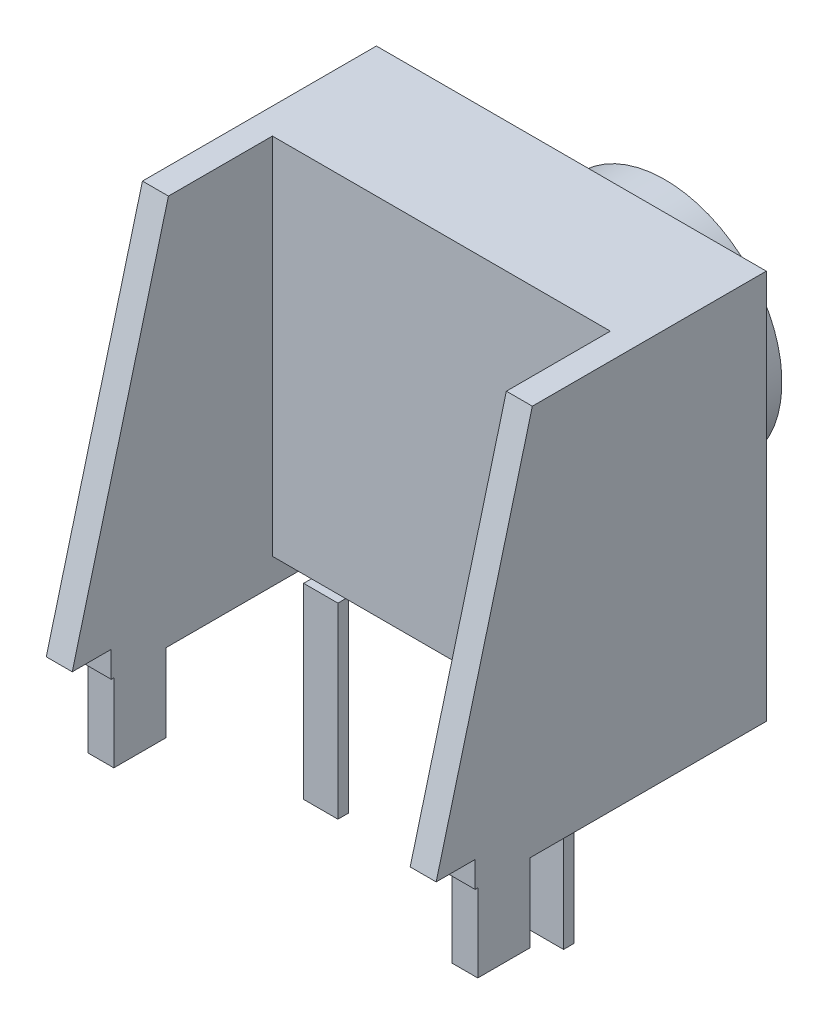
ISO-10303-21;
HEADER;
FILE_DESCRIPTION(('STEP AP214'),'2;1');
FILE_NAME('part.step','',(''),(''),'','','');
FILE_SCHEMA(('AUTOMOTIVE_DESIGN { 1 0 10303 214 1 1 1 1 }'));
ENDSEC;
DATA;
#1=APPLICATION_CONTEXT('core data for automotive mechanical design processes');
#2=APPLICATION_PROTOCOL_DEFINITION('international standard','automotive_design',2000,#1);
#3=PRODUCT_CONTEXT('',#1,'mechanical');
#4=PRODUCT('Part','Part','',(#3));
#5=PRODUCT_RELATED_PRODUCT_CATEGORY('part','',(#4));
#6=PRODUCT_DEFINITION_FORMATION('','',#4);
#7=PRODUCT_DEFINITION_CONTEXT('part definition',#1,'design');
#8=PRODUCT_DEFINITION('design','',#6,#7);
#9=PRODUCT_DEFINITION_SHAPE('','',#8);
#10=(LENGTH_UNIT() NAMED_UNIT(*) SI_UNIT(.MILLI.,.METRE.));
#11=(NAMED_UNIT(*) PLANE_ANGLE_UNIT() SI_UNIT($,.RADIAN.));
#12=(NAMED_UNIT(*) SI_UNIT($,.STERADIAN.) SOLID_ANGLE_UNIT());
#13=UNCERTAINTY_MEASURE_WITH_UNIT(LENGTH_MEASURE(1.E-05),#10,'distance_accuracy_value','');
#14=(GEOMETRIC_REPRESENTATION_CONTEXT(3) GLOBAL_UNCERTAINTY_ASSIGNED_CONTEXT((#13)) GLOBAL_UNIT_ASSIGNED_CONTEXT((#10,
#11,#12)) REPRESENTATION_CONTEXT('',''));
#15=CARTESIAN_POINT('',(0.,0.,0.));
#16=DIRECTION('',(0.,0.,1.));
#17=DIRECTION('',(1.,0.,0.));
#18=AXIS2_PLACEMENT_3D('',#15,#16,#17);
#19=CARTESIAN_POINT('',(3.75000000000001,-3.50000000000001,2.5));
#20=DIRECTION('',(0.,1.,0.));
#21=DIRECTION('',(0.,0.,1.));
#22=AXIS2_PLACEMENT_3D('',#19,#20,#21);
#23=PLANE('',#22);
#24=DIRECTION('',(1.,0.,0.));
#25=VECTOR('',#24,1.);
#26=CARTESIAN_POINT('',(-3.25000000000001,-3.50000000000001,5.6));
#27=LINE('',#26,#25);
#28=CARTESIAN_POINT('',(-3.75000000000001,-3.50000000000001,5.6));
#29=VERTEX_POINT('',#28);
#30=CARTESIAN_POINT('',(-3.25000000000001,-3.50000000000001,5.6));
#31=VERTEX_POINT('',#30);
#32=EDGE_CURVE('E289',#29,#31,#27,.T.);
#33=ORIENTED_EDGE('',*,*,#32,.T.);
#34=DIRECTION('',(0.,0.,-1.));
#35=VECTOR('',#34,1.);
#36=CARTESIAN_POINT('',(-3.25000000000001,-3.50000000000001,0.));
#37=LINE('',#36,#35);
#38=CARTESIAN_POINT('',(-3.25000000000001,-3.50000000000001,6.35));
#39=VERTEX_POINT('',#38);
#40=EDGE_CURVE('E275',#39,#31,#37,.T.);
#41=ORIENTED_EDGE('',*,*,#40,.F.);
#42=DIRECTION('',(-1.,0.,0.));
#43=VECTOR('',#42,1.);
#44=CARTESIAN_POINT('',(-3.25000000000001,-3.50000000000001,6.35));
#45=LINE('',#44,#43);
#46=CARTESIAN_POINT('',(-3.75000000000001,-3.50000000000001,6.35));
#47=VERTEX_POINT('',#46);
#48=EDGE_CURVE('E469',#39,#47,#45,.T.);
#49=ORIENTED_EDGE('',*,*,#48,.T.);
#50=DIRECTION('',(0.,0.,-1.));
#51=VECTOR('',#50,1.);
#52=CARTESIAN_POINT('',(-3.75,-3.50000000000001,2.5));
#53=LINE('',#52,#51);
#54=EDGE_CURVE('E546',#47,#29,#53,.T.);
#55=ORIENTED_EDGE('',*,*,#54,.T.);
#56=EDGE_LOOP('',(#33,#41,#49,#55));
#57=FACE_BOUND('',#56,.T.);
#58=ADVANCED_FACE('F45',(#57),#23,.F.);
#59=DIRECTION('',(1.,0.,0.));
#60=VECTOR('',#59,1.);
#61=CARTESIAN_POINT('',(3.75000000000001,-3.50000000000001,5.6));
#62=LINE('',#61,#60);
#63=CARTESIAN_POINT('',(3.25000000000001,-3.50000000000001,5.6));
#64=VERTEX_POINT('',#63);
#65=CARTESIAN_POINT('',(3.75000000000001,-3.50000000000001,5.6));
#66=VERTEX_POINT('',#65);
#67=EDGE_CURVE('E317',#64,#66,#62,.T.);
#68=ORIENTED_EDGE('',*,*,#67,.T.);
#69=DIRECTION('',(0.,0.,-1.));
#70=VECTOR('',#69,1.);
#71=CARTESIAN_POINT('',(3.75000000000001,-3.50000000000001,2.5));
#72=LINE('',#71,#70);
#73=CARTESIAN_POINT('',(3.75000000000001,-3.50000000000001,6.35));
#74=VERTEX_POINT('',#73);
#75=EDGE_CURVE('E575',#74,#66,#72,.T.);
#76=ORIENTED_EDGE('',*,*,#75,.F.);
#77=DIRECTION('',(1.,0.,0.));
#78=VECTOR('',#77,1.);
#79=CARTESIAN_POINT('',(3.25000000000001,-3.50000000000001,6.35));
#80=LINE('',#79,#78);
#81=CARTESIAN_POINT('',(3.25000000000001,-3.50000000000001,6.35));
#82=VERTEX_POINT('',#81);
#83=EDGE_CURVE('E526',#82,#74,#80,.T.);
#84=ORIENTED_EDGE('',*,*,#83,.F.);
#85=DIRECTION('',(0.,0.,-1.));
#86=VECTOR('',#85,1.);
#87=CARTESIAN_POINT('',(3.25000000000001,-3.50000000000001,2.5));
#88=LINE('',#87,#86);
#89=EDGE_CURVE('E519',#82,#64,#88,.T.);
#90=ORIENTED_EDGE('',*,*,#89,.T.);
#91=EDGE_LOOP('',(#68,#76,#84,#90));
#92=FACE_BOUND('',#91,.T.);
#93=ADVANCED_FACE('F792',(#92),#23,.F.);
#94=DIRECTION('',(1.,0.,0.));
#95=VECTOR('',#94,1.);
#96=CARTESIAN_POINT('',(3.75000000000001,-3.50000000000001,2.5));
#97=LINE('',#96,#95);
#98=CARTESIAN_POINT('',(-3.25000000000001,-3.50000000000001,2.5));
#99=VERTEX_POINT('',#98);
#100=CARTESIAN_POINT('',(-2.49971197541635,-3.50000000000001,2.5));
#101=VERTEX_POINT('',#100);
#102=EDGE_CURVE('E547',#99,#101,#97,.T.);
#103=ORIENTED_EDGE('',*,*,#102,.F.);
#104=DIRECTION('',(0.,0.,-1.));
#105=VECTOR('',#104,1.);
#106=CARTESIAN_POINT('',(-3.25000000000001,-3.50000000000001,5.6));
#107=LINE('',#106,#105);
#108=CARTESIAN_POINT('',(-3.25000000000001,-3.50000000000001,0.));
#109=VERTEX_POINT('',#108);
#110=EDGE_CURVE('E295',#99,#109,#107,.T.);
#111=ORIENTED_EDGE('',*,*,#110,.T.);
#112=DIRECTION('',(1.,0.,0.));
#113=VECTOR('',#112,1.);
#114=CARTESIAN_POINT('',(3.75000000000001,-3.50000000000001,0.));
#115=LINE('',#114,#113);
#116=CARTESIAN_POINT('',(3.25000000000001,-3.50000000000001,0.));
#117=VERTEX_POINT('',#116);
#118=EDGE_CURVE('E559',#109,#117,#115,.T.);
#119=ORIENTED_EDGE('',*,*,#118,.T.);
#120=DIRECTION('',(0.,0.,-1.));
#121=VECTOR('',#120,1.);
#122=CARTESIAN_POINT('',(3.25000000000001,-3.50000000000001,5.6));
#123=LINE('',#122,#121);
#124=CARTESIAN_POINT('',(3.25000000000001,-3.50000000000001,2.5));
#125=VERTEX_POINT('',#124);
#126=EDGE_CURVE('E327',#125,#117,#123,.T.);
#127=ORIENTED_EDGE('',*,*,#126,.F.);
#128=CARTESIAN_POINT('',(2.49971197541635,-3.50000000000001,2.5));
#129=VERTEX_POINT('',#128);
#130=EDGE_CURVE('E553',#129,#125,#97,.T.);
#131=ORIENTED_EDGE('',*,*,#130,.F.);
#132=DIRECTION('',(0.,0.,1.));
#133=VECTOR('',#132,1.);
#134=CARTESIAN_POINT('',(2.49971197541635,-3.50000000000001,2.45));
#135=LINE('',#134,#133);
#136=CARTESIAN_POINT('',(2.49971197541635,-3.50000000000001,2.45));
#137=VERTEX_POINT('',#136);
#138=EDGE_CURVE('E368',#137,#129,#135,.T.);
#139=ORIENTED_EDGE('',*,*,#138,.F.);
#140=DIRECTION('',(1.,0.,0.));
#141=VECTOR('',#140,1.);
#142=CARTESIAN_POINT('',(1.83971197541635,-3.50000000000001,2.45));
#143=LINE('',#142,#141);
#144=CARTESIAN_POINT('',(1.83971197541635,-3.50000000000001,2.45));
#145=VERTEX_POINT('',#144);
#146=EDGE_CURVE('E364',#145,#137,#143,.T.);
#147=ORIENTED_EDGE('',*,*,#146,.F.);
#148=DIRECTION('',(0.,0.,-1.));
#149=VECTOR('',#148,1.);
#150=CARTESIAN_POINT('',(1.83971197541635,-3.50000000000001,2.45));
#151=LINE('',#150,#149);
#152=CARTESIAN_POINT('',(1.83971197541635,-3.50000000000001,2.5));
#153=VERTEX_POINT('',#152);
#154=EDGE_CURVE('E344',#153,#145,#151,.T.);
#155=ORIENTED_EDGE('',*,*,#154,.F.);
#156=CARTESIAN_POINT('',(-1.83971197541635,-3.50000000000001,2.5));
#157=VERTEX_POINT('',#156);
#158=EDGE_CURVE('E655',#157,#153,#97,.T.);
#159=ORIENTED_EDGE('',*,*,#158,.F.);
#160=DIRECTION('',(0.,0.,1.));
#161=VECTOR('',#160,1.);
#162=CARTESIAN_POINT('',(-1.83971197541635,-3.50000000000001,2.45));
#163=LINE('',#162,#161);
#164=CARTESIAN_POINT('',(-1.83971197541635,-3.50000000000001,2.45));
#165=VERTEX_POINT('',#164);
#166=EDGE_CURVE('E412',#165,#157,#163,.T.);
#167=ORIENTED_EDGE('',*,*,#166,.F.);
#168=DIRECTION('',(1.,0.,0.));
#169=VECTOR('',#168,1.);
#170=CARTESIAN_POINT('',(-1.83971197541635,-3.50000000000001,2.45));
#171=LINE('',#170,#169);
#172=CARTESIAN_POINT('',(-2.49971197541635,-3.50000000000001,2.45));
#173=VERTEX_POINT('',#172);
#174=EDGE_CURVE('E408',#173,#165,#171,.T.);
#175=ORIENTED_EDGE('',*,*,#174,.F.);
#176=DIRECTION('',(0.,0.,-1.));
#177=VECTOR('',#176,1.);
#178=CARTESIAN_POINT('',(-2.49971197541635,-3.50000000000001,2.45));
#179=LINE('',#178,#177);
#180=EDGE_CURVE('E388',#101,#173,#179,.T.);
#181=ORIENTED_EDGE('',*,*,#180,.F.);
#182=EDGE_LOOP('',(#103,#111,#119,#127,#131,#139,#147,#155,#159,#167,#175,#181));
#183=FACE_BOUND('',#182,.T.);
#184=ADVANCED_FACE('F705',(#183),#23,.F.);
#185=CARTESIAN_POINT('',(-3.75,-3.50000000000001,2.5));
#186=DIRECTION('',(1.,0.,0.));
#187=DIRECTION('',(0.,0.,-1.));
#188=AXIS2_PLACEMENT_3D('',#185,#186,#187);
#189=PLANE('',#188);
#190=DIRECTION('',(0.,-1.,0.));
#191=VECTOR('',#190,1.);
#192=CARTESIAN_POINT('',(-3.75,-3.50000000000001,0.));
#193=LINE('',#192,#191);
#194=CARTESIAN_POINT('',(-3.75,3.49999999999999,0.));
#195=VERTEX_POINT('',#194);
#196=CARTESIAN_POINT('',(-3.75000000000001,-4.,0.));
#197=VERTEX_POINT('',#196);
#198=EDGE_CURVE('E541',#195,#197,#193,.T.);
#199=ORIENTED_EDGE('',*,*,#198,.T.);
#200=DIRECTION('',(0.,0.,-1.));
#201=VECTOR('',#200,1.);
#202=CARTESIAN_POINT('',(-3.75000000000001,-4.,5.6));
#203=LINE('',#202,#201);
#204=CARTESIAN_POINT('',(-3.75000000000001,-4.,4.55));
#205=VERTEX_POINT('',#204);
#206=EDGE_CURVE('E261',#205,#197,#203,.T.);
#207=ORIENTED_EDGE('',*,*,#206,.F.);
#208=DIRECTION('',(0.,1.,0.));
#209=VECTOR('',#208,1.);
#210=CARTESIAN_POINT('',(-3.75000000000001,-3.50000000000001,4.55));
#211=LINE('',#210,#209);
#212=CARTESIAN_POINT('',(-3.75000000000001,-5.50000000000001,4.55));
#213=VERTEX_POINT('',#212);
#214=EDGE_CURVE('E447',#213,#205,#211,.T.);
#215=ORIENTED_EDGE('',*,*,#214,.F.);
#216=DIRECTION('',(0.,0.,-1.));
#217=VECTOR('',#216,1.);
#218=CARTESIAN_POINT('',(-3.75000000000001,-5.50000000000001,4.55));
#219=LINE('',#218,#217);
#220=CARTESIAN_POINT('',(-3.75000000000001,-5.50000000000001,5.55));
#221=VERTEX_POINT('',#220);
#222=EDGE_CURVE('E437',#221,#213,#219,.T.);
#223=ORIENTED_EDGE('',*,*,#222,.F.);
#224=DIRECTION('',(0.,-1.,0.));
#225=VECTOR('',#224,1.);
#226=CARTESIAN_POINT('',(-3.75000000000001,-5.50000000000001,5.55));
#227=LINE('',#226,#225);
#228=CARTESIAN_POINT('',(-3.75000000000001,-4.,5.55));
#229=VERTEX_POINT('',#228);
#230=EDGE_CURVE('E432',#229,#221,#227,.T.);
#231=ORIENTED_EDGE('',*,*,#230,.F.);
#232=CARTESIAN_POINT('',(-3.75000000000001,-4.,5.6));
#233=VERTEX_POINT('',#232);
#234=EDGE_CURVE('E61',#233,#229,#203,.T.);
#235=ORIENTED_EDGE('',*,*,#234,.F.);
#236=DIRECTION('',(0.,1.,0.));
#237=VECTOR('',#236,1.);
#238=CARTESIAN_POINT('',(-3.75000000000001,-3.50000000000001,5.6));
#239=LINE('',#238,#237);
#240=EDGE_CURVE('E269',#233,#29,#239,.T.);
#241=ORIENTED_EDGE('',*,*,#240,.T.);
#242=ORIENTED_EDGE('',*,*,#54,.F.);
#243=DIRECTION('',(0.,-0.966805641264237,0.255512919476977));
#244=VECTOR('',#243,1.);
#245=CARTESIAN_POINT('',(-3.75000000000001,-3.50000000000001,6.35));
#246=LINE('',#245,#244);
#247=CARTESIAN_POINT('',(-3.75000000000001,3.49999999999999,4.5));
#248=VERTEX_POINT('',#247);
#249=EDGE_CURVE('E457',#248,#47,#246,.T.);
#250=ORIENTED_EDGE('',*,*,#249,.F.);
#251=DIRECTION('',(0.,0.,-1.));
#252=VECTOR('',#251,1.);
#253=CARTESIAN_POINT('',(-3.75,3.49999999999999,2.5));
#254=LINE('',#253,#252);
#255=EDGE_CURVE('E556',#248,#195,#254,.T.);
#256=ORIENTED_EDGE('',*,*,#255,.T.);
#257=EDGE_LOOP('',(#199,#207,#215,#223,#231,#235,#241,#242,#250,#256));
#258=FACE_BOUND('',#257,.T.);
#259=ADVANCED_FACE('F47',(#258),#189,.F.);
#260=CARTESIAN_POINT('',(3.75000000000001,-3.50000000000001,2.5));
#261=DIRECTION('',(-1.,0.,0.));
#262=DIRECTION('',(0.,0.,1.));
#263=AXIS2_PLACEMENT_3D('',#260,#261,#262);
#264=PLANE('',#263);
#265=DIRECTION('',(0.,1.,0.));
#266=VECTOR('',#265,1.);
#267=CARTESIAN_POINT('',(3.75000000000001,-3.50000000000001,4.55));
#268=LINE('',#267,#266);
#269=CARTESIAN_POINT('',(3.75000000000001,-5.50000000000001,4.55));
#270=VERTEX_POINT('',#269);
#271=CARTESIAN_POINT('',(3.75000000000001,-4.,4.55));
#272=VERTEX_POINT('',#271);
#273=EDGE_CURVE('E489',#270,#272,#268,.T.);
#274=ORIENTED_EDGE('',*,*,#273,.T.);
#275=DIRECTION('',(0.,0.,-1.));
#276=VECTOR('',#275,1.);
#277=CARTESIAN_POINT('',(3.75000000000001,-4.,5.6));
#278=LINE('',#277,#276);
#279=CARTESIAN_POINT('',(3.75000000000001,-4.,0.));
#280=VERTEX_POINT('',#279);
#281=EDGE_CURVE('E320',#272,#280,#278,.T.);
#282=ORIENTED_EDGE('',*,*,#281,.T.);
#283=DIRECTION('',(0.,1.,0.));
#284=VECTOR('',#283,1.);
#285=CARTESIAN_POINT('',(3.75000000000001,-3.50000000000001,0.));
#286=LINE('',#285,#284);
#287=CARTESIAN_POINT('',(3.75000000000001,3.49999999999999,0.));
#288=VERTEX_POINT('',#287);
#289=EDGE_CURVE('E562',#280,#288,#286,.T.);
#290=ORIENTED_EDGE('',*,*,#289,.T.);
#291=DIRECTION('',(0.,0.,-1.));
#292=VECTOR('',#291,1.);
#293=CARTESIAN_POINT('',(3.75000000000001,3.49999999999999,2.5));
#294=LINE('',#293,#292);
#295=CARTESIAN_POINT('',(3.75000000000001,3.49999999999999,4.5));
#296=VERTEX_POINT('',#295);
#297=EDGE_CURVE('E571',#296,#288,#294,.T.);
#298=ORIENTED_EDGE('',*,*,#297,.F.);
#299=DIRECTION('',(0.,-0.966805641264237,0.255512919476977));
#300=VECTOR('',#299,1.);
#301=CARTESIAN_POINT('',(3.75000000000001,-3.50000000000001,6.35));
#302=LINE('',#301,#300);
#303=EDGE_CURVE('E508',#296,#74,#302,.T.);
#304=ORIENTED_EDGE('',*,*,#303,.T.);
#305=ORIENTED_EDGE('',*,*,#75,.T.);
#306=DIRECTION('',(0.,-1.,0.));
#307=VECTOR('',#306,1.);
#308=CARTESIAN_POINT('',(3.75000000000001,-3.50000000000001,5.6));
#309=LINE('',#308,#307);
#310=CARTESIAN_POINT('',(3.75000000000001,-4.,5.6));
#311=VERTEX_POINT('',#310);
#312=EDGE_CURVE('E304',#66,#311,#309,.T.);
#313=ORIENTED_EDGE('',*,*,#312,.T.);
#314=CARTESIAN_POINT('',(3.75000000000001,-4.,5.55));
#315=VERTEX_POINT('',#314);
#316=EDGE_CURVE('E337',#311,#315,#278,.T.);
#317=ORIENTED_EDGE('',*,*,#316,.T.);
#318=DIRECTION('',(0.,-1.,0.));
#319=VECTOR('',#318,1.);
#320=CARTESIAN_POINT('',(3.75000000000001,-5.50000000000001,5.55));
#321=LINE('',#320,#319);
#322=CARTESIAN_POINT('',(3.75000000000001,-5.50000000000001,5.55));
#323=VERTEX_POINT('',#322);
#324=EDGE_CURVE('E484',#315,#323,#321,.T.);
#325=ORIENTED_EDGE('',*,*,#324,.T.);
#326=DIRECTION('',(0.,0.,-1.));
#327=VECTOR('',#326,1.);
#328=CARTESIAN_POINT('',(3.75000000000001,-5.50000000000001,4.55));
#329=LINE('',#328,#327);
#330=EDGE_CURVE('E498',#323,#270,#329,.T.);
#331=ORIENTED_EDGE('',*,*,#330,.T.);
#332=EDGE_LOOP('',(#274,#282,#290,#298,#304,#305,#313,#317,#325,#331));
#333=FACE_BOUND('',#332,.T.);
#334=ADVANCED_FACE('F802',(#333),#264,.F.);
#335=CARTESIAN_POINT('',(3.75000000000001,3.49999999999999,2.5));
#336=DIRECTION('',(0.,-1.,0.));
#337=DIRECTION('',(0.,0.,-1.));
#338=AXIS2_PLACEMENT_3D('',#335,#336,#337);
#339=PLANE('',#338);
#340=DIRECTION('',(-1.,0.,0.));
#341=VECTOR('',#340,1.);
#342=CARTESIAN_POINT('',(3.75000000000001,3.49999999999999,0.));
#343=LINE('',#342,#341);
#344=EDGE_CURVE('E565',#288,#195,#343,.T.);
#345=ORIENTED_EDGE('',*,*,#344,.T.);
#346=ORIENTED_EDGE('',*,*,#255,.F.);
#347=DIRECTION('',(-1.,0.,0.));
#348=VECTOR('',#347,1.);
#349=CARTESIAN_POINT('',(-3.25000000000001,3.49999999999999,4.5));
#350=LINE('',#349,#348);
#351=CARTESIAN_POINT('',(-3.25000000000001,3.49999999999999,4.5));
#352=VERTEX_POINT('',#351);
#353=EDGE_CURVE('E473',#352,#248,#350,.T.);
#354=ORIENTED_EDGE('',*,*,#353,.F.);
#355=DIRECTION('',(0.,0.,1.));
#356=VECTOR('',#355,1.);
#357=CARTESIAN_POINT('',(-3.25000000000001,3.49999999999999,4.5));
#358=LINE('',#357,#356);
#359=CARTESIAN_POINT('',(-3.25000000000001,3.49999999999999,2.5));
#360=VERTEX_POINT('',#359);
#361=EDGE_CURVE('E461',#360,#352,#358,.T.);
#362=ORIENTED_EDGE('',*,*,#361,.F.);
#363=DIRECTION('',(-1.,0.,0.));
#364=VECTOR('',#363,1.);
#365=CARTESIAN_POINT('',(3.75000000000001,3.49999999999999,2.5));
#366=LINE('',#365,#364);
#367=CARTESIAN_POINT('',(3.25000000000001,3.49999999999999,2.5));
#368=VERTEX_POINT('',#367);
#369=EDGE_CURVE('E551',#368,#360,#366,.T.);
#370=ORIENTED_EDGE('',*,*,#369,.F.);
#371=DIRECTION('',(0.,0.,1.));
#372=VECTOR('',#371,1.);
#373=CARTESIAN_POINT('',(3.25000000000001,3.49999999999999,4.5));
#374=LINE('',#373,#372);
#375=CARTESIAN_POINT('',(3.25000000000001,3.49999999999999,4.5));
#376=VERTEX_POINT('',#375);
#377=EDGE_CURVE('E512',#368,#376,#374,.T.);
#378=ORIENTED_EDGE('',*,*,#377,.T.);
#379=DIRECTION('',(1.,0.,0.));
#380=VECTOR('',#379,1.);
#381=CARTESIAN_POINT('',(3.25000000000001,3.49999999999999,4.5));
#382=LINE('',#381,#380);
#383=EDGE_CURVE('E522',#376,#296,#382,.T.);
#384=ORIENTED_EDGE('',*,*,#383,.T.);
#385=ORIENTED_EDGE('',*,*,#297,.T.);
#386=EDGE_LOOP('',(#345,#346,#354,#362,#370,#378,#384,#385));
#387=FACE_BOUND('',#386,.T.);
#388=ADVANCED_FACE('F715',(#387),#339,.F.);
#389=CARTESIAN_POINT('',(0.,0.,2.5));
#390=DIRECTION('',(0.,0.,1.));
#391=DIRECTION('',(1.,0.,0.));
#392=AXIS2_PLACEMENT_3D('',#389,#390,#391);
#393=PLANE('',#392);
#394=DIRECTION('',(0.,1.,0.));
#395=VECTOR('',#394,1.);
#396=CARTESIAN_POINT('',(-3.25000000000001,0.,2.5));
#397=LINE('',#396,#395);
#398=EDGE_CURVE('E477',#99,#360,#397,.T.);
#399=ORIENTED_EDGE('',*,*,#398,.F.);
#400=ORIENTED_EDGE('',*,*,#102,.T.);
#401=EDGE_CURVE('E552',#101,#157,#97,.T.);
#402=ORIENTED_EDGE('',*,*,#401,.T.);
#403=ORIENTED_EDGE('',*,*,#158,.T.);
#404=EDGE_CURVE('E652',#153,#129,#97,.T.);
#405=ORIENTED_EDGE('',*,*,#404,.T.);
#406=ORIENTED_EDGE('',*,*,#130,.T.);
#407=DIRECTION('',(0.,-1.,0.));
#408=VECTOR('',#407,1.);
#409=CARTESIAN_POINT('',(3.25000000000001,0.,2.5));
#410=LINE('',#409,#408);
#411=EDGE_CURVE('E530',#368,#125,#410,.T.);
#412=ORIENTED_EDGE('',*,*,#411,.F.);
#413=ORIENTED_EDGE('',*,*,#369,.T.);
#414=EDGE_LOOP('',(#399,#400,#402,#403,#405,#406,#412,#413));
#415=FACE_BOUND('',#414,.T.);
#416=ADVANCED_FACE('F712',(#415),#393,.T.);
#417=CARTESIAN_POINT('',(0.,0.,0.));
#418=DIRECTION('',(0.,0.,1.));
#419=DIRECTION('',(1.,0.,0.));
#420=AXIS2_PLACEMENT_3D('',#417,#418,#419);
#421=PLANE('',#420);
#422=CARTESIAN_POINT('',(0.,0.,0.));
#423=DIRECTION('',(0.,0.,-1.));
#424=DIRECTION('',(-1.,0.,0.));
#425=AXIS2_PLACEMENT_3D('',#422,#423,#424);
#426=CIRCLE('',#425,2.25);
#427=CARTESIAN_POINT('',(-2.25,0.,0.));
#428=VERTEX_POINT('',#427);
#429=EDGE_CURVE('E542',#428,#428,#426,.T.);
#430=ORIENTED_EDGE('',*,*,#429,.F.);
#431=EDGE_LOOP('',(#430));
#432=FACE_BOUND('',#431,.T.);
#433=ORIENTED_EDGE('',*,*,#289,.F.);
#434=DIRECTION('',(-1.,0.,0.));
#435=VECTOR('',#434,1.);
#436=CARTESIAN_POINT('',(3.75000000000001,-4.,0.));
#437=LINE('',#436,#435);
#438=CARTESIAN_POINT('',(3.25000000000001,-4.,0.));
#439=VERTEX_POINT('',#438);
#440=EDGE_CURVE('E303',#280,#439,#437,.T.);
#441=ORIENTED_EDGE('',*,*,#440,.T.);
#442=DIRECTION('',(0.,1.,0.));
#443=VECTOR('',#442,1.);
#444=CARTESIAN_POINT('',(3.25000000000001,-3.50000000000001,0.));
#445=LINE('',#444,#443);
#446=EDGE_CURVE('E309',#439,#117,#445,.T.);
#447=ORIENTED_EDGE('',*,*,#446,.T.);
#448=ORIENTED_EDGE('',*,*,#118,.F.);
#449=DIRECTION('',(0.,-1.,0.));
#450=VECTOR('',#449,1.);
#451=CARTESIAN_POINT('',(-3.25000000000001,-3.50000000000001,0.));
#452=LINE('',#451,#450);
#453=CARTESIAN_POINT('',(-3.25000000000001,-4.,0.));
#454=VERTEX_POINT('',#453);
#455=EDGE_CURVE('E284',#109,#454,#452,.T.);
#456=ORIENTED_EDGE('',*,*,#455,.T.);
#457=DIRECTION('',(-1.,0.,0.));
#458=VECTOR('',#457,1.);
#459=CARTESIAN_POINT('',(-3.25000000000001,-4.,0.));
#460=LINE('',#459,#458);
#461=EDGE_CURVE('E277',#454,#197,#460,.T.);
#462=ORIENTED_EDGE('',*,*,#461,.T.);
#463=ORIENTED_EDGE('',*,*,#198,.F.);
#464=ORIENTED_EDGE('',*,*,#344,.F.);
#465=EDGE_LOOP('',(#433,#441,#447,#448,#456,#462,#463,#464));
#466=FACE_BOUND('',#465,.T.);
#467=ADVANCED_FACE('F702',(#432,#466),#421,.F.);
#468=CARTESIAN_POINT('',(0.,0.,-1.8));
#469=DIRECTION('',(0.,0.,1.));
#470=DIRECTION('',(1.,0.,0.));
#471=AXIS2_PLACEMENT_3D('',#468,#469,#470);
#472=CYLINDRICAL_SURFACE('',#471,2.25);
#473=CARTESIAN_POINT('',(0.,0.,-1.8));
#474=DIRECTION('',(0.,0.,-1.));
#475=DIRECTION('',(-1.,0.,0.));
#476=AXIS2_PLACEMENT_3D('',#473,#474,#475);
#477=CIRCLE('',#476,2.25);
#478=CARTESIAN_POINT('',(-2.25,0.,-1.8));
#479=VERTEX_POINT('',#478);
#480=EDGE_CURVE('E537',#479,#479,#477,.T.);
#481=ORIENTED_EDGE('',*,*,#480,.F.);
#482=EDGE_LOOP('',(#481));
#483=FACE_BOUND('',#482,.T.);
#484=ORIENTED_EDGE('',*,*,#429,.T.);
#485=EDGE_LOOP('',(#484));
#486=FACE_BOUND('',#485,.T.);
#487=ADVANCED_FACE('F814',(#483,#486),#472,.T.);
#488=CARTESIAN_POINT('',(0.,0.,-1.8));
#489=DIRECTION('',(0.,0.,-1.));
#490=DIRECTION('',(-1.,0.,0.));
#491=AXIS2_PLACEMENT_3D('',#488,#489,#490);
#492=PLANE('',#491);
#493=ORIENTED_EDGE('',*,*,#480,.T.);
#494=EDGE_LOOP('',(#493));
#495=FACE_BOUND('',#494,.T.);
#496=ADVANCED_FACE('F820',(#495),#492,.T.);
#497=CARTESIAN_POINT('',(3.25000000000001,-3.50000000000001,6.35));
#498=DIRECTION('',(0.,0.255512919476977,0.966805641264237));
#499=DIRECTION('',(0.,-0.966805641264237,0.255512919476977));
#500=AXIS2_PLACEMENT_3D('',#497,#498,#499);
#501=PLANE('',#500);
#502=ORIENTED_EDGE('',*,*,#303,.F.);
#503=ORIENTED_EDGE('',*,*,#383,.F.);
#504=DIRECTION('',(0.,-0.966805641264237,0.255512919476977));
#505=VECTOR('',#504,1.);
#506=CARTESIAN_POINT('',(3.25000000000001,-3.50000000000001,6.35));
#507=LINE('',#506,#505);
#508=EDGE_CURVE('E515',#376,#82,#507,.T.);
#509=ORIENTED_EDGE('',*,*,#508,.T.);
#510=ORIENTED_EDGE('',*,*,#83,.T.);
#511=EDGE_LOOP('',(#502,#503,#509,#510));
#512=FACE_BOUND('',#511,.T.);
#513=ADVANCED_FACE('F824',(#512),#501,.T.);
#514=CARTESIAN_POINT('',(3.25000000000001,0.,0.));
#515=DIRECTION('',(-1.,0.,0.));
#516=DIRECTION('',(0.,0.,1.));
#517=AXIS2_PLACEMENT_3D('',#514,#515,#516);
#518=PLANE('',#517);
#519=DIRECTION('',(0.,-1.,0.));
#520=VECTOR('',#519,1.);
#521=CARTESIAN_POINT('',(3.25000000000001,-5.50000000000001,5.55));
#522=LINE('',#521,#520);
#523=CARTESIAN_POINT('',(3.25000000000001,-4.,5.55));
#524=VERTEX_POINT('',#523);
#525=CARTESIAN_POINT('',(3.25000000000001,-5.50000000000001,5.55));
#526=VERTEX_POINT('',#525);
#527=EDGE_CURVE('E485',#524,#526,#522,.T.);
#528=ORIENTED_EDGE('',*,*,#527,.F.);
#529=DIRECTION('',(0.,0.,-1.));
#530=VECTOR('',#529,1.);
#531=CARTESIAN_POINT('',(3.25000000000001,-4.,5.6));
#532=LINE('',#531,#530);
#533=CARTESIAN_POINT('',(3.25000000000001,-4.,5.6));
#534=VERTEX_POINT('',#533);
#535=EDGE_CURVE('E332',#534,#524,#532,.T.);
#536=ORIENTED_EDGE('',*,*,#535,.F.);
#537=DIRECTION('',(0.,1.,0.));
#538=VECTOR('',#537,1.);
#539=CARTESIAN_POINT('',(3.25000000000001,-3.50000000000001,5.6));
#540=LINE('',#539,#538);
#541=EDGE_CURVE('E313',#534,#64,#540,.T.);
#542=ORIENTED_EDGE('',*,*,#541,.T.);
#543=ORIENTED_EDGE('',*,*,#89,.F.);
#544=ORIENTED_EDGE('',*,*,#508,.F.);
#545=ORIENTED_EDGE('',*,*,#377,.F.);
#546=ORIENTED_EDGE('',*,*,#411,.T.);
#547=ORIENTED_EDGE('',*,*,#126,.T.);
#548=ORIENTED_EDGE('',*,*,#446,.F.);
#549=CARTESIAN_POINT('',(3.25000000000001,-4.,4.55));
#550=VERTEX_POINT('',#549);
#551=EDGE_CURVE('E336',#550,#439,#532,.T.);
#552=ORIENTED_EDGE('',*,*,#551,.F.);
#553=DIRECTION('',(0.,1.,0.));
#554=VECTOR('',#553,1.);
#555=CARTESIAN_POINT('',(3.25000000000001,-3.50000000000001,4.55));
#556=LINE('',#555,#554);
#557=CARTESIAN_POINT('',(3.25000000000001,-5.50000000000001,4.55));
#558=VERTEX_POINT('',#557);
#559=EDGE_CURVE('E493',#558,#550,#556,.T.);
#560=ORIENTED_EDGE('',*,*,#559,.F.);
#561=DIRECTION('',(0.,0.,-1.));
#562=VECTOR('',#561,1.);
#563=CARTESIAN_POINT('',(3.25000000000001,-5.50000000000001,4.55));
#564=LINE('',#563,#562);
#565=EDGE_CURVE('E488',#526,#558,#564,.T.);
#566=ORIENTED_EDGE('',*,*,#565,.F.);
#567=EDGE_LOOP('',(#528,#536,#542,#543,#544,#545,#546,#547,#548,#552,#560,#566));
#568=FACE_BOUND('',#567,.T.);
#569=ADVANCED_FACE('F597',(#568),#518,.T.);
#570=CARTESIAN_POINT('',(3.25000000000001,-5.50000000000001,5.55));
#571=DIRECTION('',(0.,0.,1.));
#572=DIRECTION('',(1.,0.,0.));
#573=AXIS2_PLACEMENT_3D('',#570,#571,#572);
#574=PLANE('',#573);
#575=DIRECTION('',(1.,0.,0.));
#576=VECTOR('',#575,1.);
#577=CARTESIAN_POINT('',(3.25000000000001,-4.,5.55));
#578=LINE('',#577,#576);
#579=EDGE_CURVE('E331',#524,#315,#578,.T.);
#580=ORIENTED_EDGE('',*,*,#579,.F.);
#581=ORIENTED_EDGE('',*,*,#527,.T.);
#582=DIRECTION('',(1.,0.,0.));
#583=VECTOR('',#582,1.);
#584=CARTESIAN_POINT('',(3.25000000000001,-5.50000000000001,5.55));
#585=LINE('',#584,#583);
#586=EDGE_CURVE('E495',#526,#323,#585,.T.);
#587=ORIENTED_EDGE('',*,*,#586,.T.);
#588=ORIENTED_EDGE('',*,*,#324,.F.);
#589=EDGE_LOOP('',(#580,#581,#587,#588));
#590=FACE_BOUND('',#589,.T.);
#591=ADVANCED_FACE('F831',(#590),#574,.T.);
#592=CARTESIAN_POINT('',(3.25000000000001,-3.50000000000001,4.55));
#593=DIRECTION('',(0.,0.,-1.));
#594=DIRECTION('',(-1.,0.,0.));
#595=AXIS2_PLACEMENT_3D('',#592,#593,#594);
#596=PLANE('',#595);
#597=DIRECTION('',(-1.,0.,0.));
#598=VECTOR('',#597,1.);
#599=CARTESIAN_POINT('',(3.25000000000001,-4.,4.55));
#600=LINE('',#599,#598);
#601=EDGE_CURVE('E54',#272,#550,#600,.T.);
#602=ORIENTED_EDGE('',*,*,#601,.F.);
#603=ORIENTED_EDGE('',*,*,#273,.F.);
#604=DIRECTION('',(1.,0.,0.));
#605=VECTOR('',#604,1.);
#606=CARTESIAN_POINT('',(3.25000000000001,-5.50000000000001,4.55));
#607=LINE('',#606,#605);
#608=EDGE_CURVE('E505',#558,#270,#607,.T.);
#609=ORIENTED_EDGE('',*,*,#608,.F.);
#610=ORIENTED_EDGE('',*,*,#559,.T.);
#611=EDGE_LOOP('',(#602,#603,#609,#610));
#612=FACE_BOUND('',#611,.T.);
#613=ADVANCED_FACE('F834',(#612),#596,.T.);
#614=CARTESIAN_POINT('',(3.25000000000001,-5.50000000000001,4.55));
#615=DIRECTION('',(0.,-1.,0.));
#616=DIRECTION('',(0.,0.,-1.));
#617=AXIS2_PLACEMENT_3D('',#614,#615,#616);
#618=PLANE('',#617);
#619=ORIENTED_EDGE('',*,*,#330,.F.);
#620=ORIENTED_EDGE('',*,*,#586,.F.);
#621=ORIENTED_EDGE('',*,*,#565,.T.);
#622=ORIENTED_EDGE('',*,*,#608,.T.);
#623=EDGE_LOOP('',(#619,#620,#621,#622));
#624=FACE_BOUND('',#623,.T.);
#625=ADVANCED_FACE('F836',(#624),#618,.T.);
#626=CARTESIAN_POINT('',(-3.25000000000001,-3.50000000000001,6.35));
#627=DIRECTION('',(0.,-0.255512919476977,-0.966805641264237));
#628=DIRECTION('',(0.,0.966805641264237,-0.255512919476977));
#629=AXIS2_PLACEMENT_3D('',#626,#627,#628);
#630=PLANE('',#629);
#631=ORIENTED_EDGE('',*,*,#249,.T.);
#632=ORIENTED_EDGE('',*,*,#48,.F.);
#633=DIRECTION('',(0.,-0.966805641264237,0.255512919476977));
#634=VECTOR('',#633,1.);
#635=CARTESIAN_POINT('',(-3.25000000000001,-3.50000000000001,6.35));
#636=LINE('',#635,#634);
#637=EDGE_CURVE('E466',#352,#39,#636,.T.);
#638=ORIENTED_EDGE('',*,*,#637,.F.);
#639=ORIENTED_EDGE('',*,*,#353,.T.);
#640=EDGE_LOOP('',(#631,#632,#638,#639));
#641=FACE_BOUND('',#640,.T.);
#642=ADVANCED_FACE('F721',(#641),#630,.F.);
#643=CARTESIAN_POINT('',(-3.25000000000001,0.,0.));
#644=DIRECTION('',(1.,0.,0.));
#645=DIRECTION('',(0.,0.,1.));
#646=AXIS2_PLACEMENT_3D('',#643,#644,#645);
#647=PLANE('',#646);
#648=ORIENTED_EDGE('',*,*,#110,.F.);
#649=ORIENTED_EDGE('',*,*,#398,.T.);
#650=ORIENTED_EDGE('',*,*,#361,.T.);
#651=ORIENTED_EDGE('',*,*,#637,.T.);
#652=ORIENTED_EDGE('',*,*,#40,.T.);
#653=DIRECTION('',(0.,-1.,0.));
#654=VECTOR('',#653,1.);
#655=CARTESIAN_POINT('',(-3.25000000000001,-3.50000000000001,5.6));
#656=LINE('',#655,#654);
#657=CARTESIAN_POINT('',(-3.25000000000001,-4.,5.6));
#658=VERTEX_POINT('',#657);
#659=EDGE_CURVE('E267',#31,#658,#656,.T.);
#660=ORIENTED_EDGE('',*,*,#659,.T.);
#661=DIRECTION('',(0.,0.,-1.));
#662=VECTOR('',#661,1.);
#663=CARTESIAN_POINT('',(-3.25000000000001,-4.,5.6));
#664=LINE('',#663,#662);
#665=CARTESIAN_POINT('',(-3.25000000000001,-4.,5.55));
#666=VERTEX_POINT('',#665);
#667=EDGE_CURVE('E252',#658,#666,#664,.T.);
#668=ORIENTED_EDGE('',*,*,#667,.T.);
#669=DIRECTION('',(0.,-1.,0.));
#670=VECTOR('',#669,1.);
#671=CARTESIAN_POINT('',(-3.25000000000001,-5.50000000000001,5.55));
#672=LINE('',#671,#670);
#673=CARTESIAN_POINT('',(-3.25000000000001,-5.50000000000001,5.55));
#674=VERTEX_POINT('',#673);
#675=EDGE_CURVE('E433',#666,#674,#672,.T.);
#676=ORIENTED_EDGE('',*,*,#675,.T.);
#677=DIRECTION('',(0.,0.,-1.));
#678=VECTOR('',#677,1.);
#679=CARTESIAN_POINT('',(-3.25000000000001,-5.50000000000001,4.55));
#680=LINE('',#679,#678);
#681=CARTESIAN_POINT('',(-3.25000000000001,-5.50000000000001,4.55));
#682=VERTEX_POINT('',#681);
#683=EDGE_CURVE('E441',#674,#682,#680,.T.);
#684=ORIENTED_EDGE('',*,*,#683,.T.);
#685=DIRECTION('',(0.,1.,0.));
#686=VECTOR('',#685,1.);
#687=CARTESIAN_POINT('',(-3.25000000000001,-3.50000000000001,4.55));
#688=LINE('',#687,#686);
#689=CARTESIAN_POINT('',(-3.25000000000001,-4.,4.55));
#690=VERTEX_POINT('',#689);
#691=EDGE_CURVE('E436',#682,#690,#688,.T.);
#692=ORIENTED_EDGE('',*,*,#691,.T.);
#693=EDGE_CURVE('E69',#690,#454,#664,.T.);
#694=ORIENTED_EDGE('',*,*,#693,.T.);
#695=ORIENTED_EDGE('',*,*,#455,.F.);
#696=EDGE_LOOP('',(#648,#649,#650,#651,#652,#660,#668,#676,#684,#692,#694,#695));
#697=FACE_BOUND('',#696,.T.);
#698=ADVANCED_FACE('F273',(#697),#647,.T.);
#699=CARTESIAN_POINT('',(-3.25000000000001,-5.50000000000001,5.55));
#700=DIRECTION('',(0.,0.,-1.));
#701=DIRECTION('',(-1.,0.,0.));
#702=AXIS2_PLACEMENT_3D('',#699,#700,#701);
#703=PLANE('',#702);
#704=ORIENTED_EDGE('',*,*,#675,.F.);
#705=DIRECTION('',(-1.,0.,0.));
#706=VECTOR('',#705,1.);
#707=CARTESIAN_POINT('',(-3.25000000000001,-4.,5.55));
#708=LINE('',#707,#706);
#709=EDGE_CURVE('E256',#666,#229,#708,.T.);
#710=ORIENTED_EDGE('',*,*,#709,.T.);
#711=ORIENTED_EDGE('',*,*,#230,.T.);
#712=DIRECTION('',(-1.,0.,0.));
#713=VECTOR('',#712,1.);
#714=CARTESIAN_POINT('',(-3.25000000000001,-5.50000000000001,5.55));
#715=LINE('',#714,#713);
#716=EDGE_CURVE('E453',#674,#221,#715,.T.);
#717=ORIENTED_EDGE('',*,*,#716,.F.);
#718=EDGE_LOOP('',(#704,#710,#711,#717));
#719=FACE_BOUND('',#718,.T.);
#720=ADVANCED_FACE('F730',(#719),#703,.F.);
#721=CARTESIAN_POINT('',(-3.25000000000001,-5.50000000000001,4.55));
#722=DIRECTION('',(0.,1.,0.));
#723=DIRECTION('',(0.,0.,1.));
#724=AXIS2_PLACEMENT_3D('',#721,#722,#723);
#725=PLANE('',#724);
#726=ORIENTED_EDGE('',*,*,#222,.T.);
#727=DIRECTION('',(-1.,0.,0.));
#728=VECTOR('',#727,1.);
#729=CARTESIAN_POINT('',(-3.25000000000001,-5.50000000000001,4.55));
#730=LINE('',#729,#728);
#731=EDGE_CURVE('E444',#682,#213,#730,.T.);
#732=ORIENTED_EDGE('',*,*,#731,.F.);
#733=ORIENTED_EDGE('',*,*,#683,.F.);
#734=ORIENTED_EDGE('',*,*,#716,.T.);
#735=EDGE_LOOP('',(#726,#732,#733,#734));
#736=FACE_BOUND('',#735,.T.);
#737=ADVANCED_FACE('F734',(#736),#725,.F.);
#738=CARTESIAN_POINT('',(-3.25000000000001,-3.50000000000001,4.55));
#739=DIRECTION('',(0.,0.,1.));
#740=DIRECTION('',(1.,0.,0.));
#741=AXIS2_PLACEMENT_3D('',#738,#739,#740);
#742=PLANE('',#741);
#743=ORIENTED_EDGE('',*,*,#214,.T.);
#744=DIRECTION('',(1.,0.,0.));
#745=VECTOR('',#744,1.);
#746=CARTESIAN_POINT('',(-3.25000000000001,-4.,4.55));
#747=LINE('',#746,#745);
#748=EDGE_CURVE('E11',#205,#690,#747,.T.);
#749=ORIENTED_EDGE('',*,*,#748,.T.);
#750=ORIENTED_EDGE('',*,*,#691,.F.);
#751=ORIENTED_EDGE('',*,*,#731,.T.);
#752=EDGE_LOOP('',(#743,#749,#750,#751));
#753=FACE_BOUND('',#752,.T.);
#754=ADVANCED_FACE('F736',(#753),#742,.F.);
#755=CARTESIAN_POINT('',(-2.49971197541635,-7.10000000000001,2.45));
#756=DIRECTION('',(1.,0.,0.));
#757=DIRECTION('',(0.,0.,-1.));
#758=AXIS2_PLACEMENT_3D('',#755,#756,#757);
#759=PLANE('',#758);
#760=CARTESIAN_POINT('',(-2.49971197541635,-3.50000000000001,2.65));
#761=VERTEX_POINT('',#760);
#762=EDGE_CURVE('E404',#761,#101,#179,.T.);
#763=ORIENTED_EDGE('',*,*,#762,.T.);
#764=ORIENTED_EDGE('',*,*,#180,.T.);
#765=DIRECTION('',(0.,1.,0.));
#766=VECTOR('',#765,1.);
#767=CARTESIAN_POINT('',(-2.49971197541635,-7.10000000000001,2.45));
#768=LINE('',#767,#766);
#769=CARTESIAN_POINT('',(-2.49971197541635,-7.10000000000001,2.45));
#770=VERTEX_POINT('',#769);
#771=EDGE_CURVE('E428',#770,#173,#768,.T.);
#772=ORIENTED_EDGE('',*,*,#771,.F.);
#773=DIRECTION('',(0.,0.,-1.));
#774=VECTOR('',#773,1.);
#775=CARTESIAN_POINT('',(-2.49971197541635,-7.10000000000001,2.45));
#776=LINE('',#775,#774);
#777=CARTESIAN_POINT('',(-2.49971197541635,-7.10000000000001,2.65));
#778=VERTEX_POINT('',#777);
#779=EDGE_CURVE('E389',#778,#770,#776,.T.);
#780=ORIENTED_EDGE('',*,*,#779,.F.);
#781=DIRECTION('',(0.,1.,0.));
#782=VECTOR('',#781,1.);
#783=CARTESIAN_POINT('',(-2.49971197541635,-7.10000000000001,2.65));
#784=LINE('',#783,#782);
#785=EDGE_CURVE('E403',#778,#761,#784,.T.);
#786=ORIENTED_EDGE('',*,*,#785,.T.);
#787=EDGE_LOOP('',(#763,#764,#772,#780,#786));
#788=FACE_BOUND('',#787,.T.);
#789=ADVANCED_FACE('F850',(#788),#759,.F.);
#790=CARTESIAN_POINT('',(-1.83971197541635,-7.10000000000001,2.45));
#791=DIRECTION('',(0.,0.,1.));
#792=DIRECTION('',(1.,0.,0.));
#793=AXIS2_PLACEMENT_3D('',#790,#791,#792);
#794=PLANE('',#793);
#795=ORIENTED_EDGE('',*,*,#174,.T.);
#796=DIRECTION('',(0.,1.,0.));
#797=VECTOR('',#796,1.);
#798=CARTESIAN_POINT('',(-1.83971197541635,-7.10000000000001,2.45));
#799=LINE('',#798,#797);
#800=CARTESIAN_POINT('',(-1.83971197541635,-7.10000000000001,2.45));
#801=VERTEX_POINT('',#800);
#802=EDGE_CURVE('E424',#801,#165,#799,.T.);
#803=ORIENTED_EDGE('',*,*,#802,.F.);
#804=DIRECTION('',(1.,0.,0.));
#805=VECTOR('',#804,1.);
#806=CARTESIAN_POINT('',(-1.83971197541635,-7.10000000000001,2.45));
#807=LINE('',#806,#805);
#808=EDGE_CURVE('E393',#770,#801,#807,.T.);
#809=ORIENTED_EDGE('',*,*,#808,.F.);
#810=ORIENTED_EDGE('',*,*,#771,.T.);
#811=EDGE_LOOP('',(#795,#803,#809,#810));
#812=FACE_BOUND('',#811,.T.);
#813=ADVANCED_FACE('F855',(#812),#794,.F.);
#814=CARTESIAN_POINT('',(-1.83971197541635,-7.10000000000001,2.45));
#815=DIRECTION('',(-1.,0.,0.));
#816=DIRECTION('',(0.,0.,1.));
#817=AXIS2_PLACEMENT_3D('',#814,#815,#816);
#818=PLANE('',#817);
#819=ORIENTED_EDGE('',*,*,#166,.T.);
#820=CARTESIAN_POINT('',(-1.83971197541635,-3.50000000000001,2.65));
#821=VERTEX_POINT('',#820);
#822=EDGE_CURVE('E411',#157,#821,#163,.T.);
#823=ORIENTED_EDGE('',*,*,#822,.T.);
#824=DIRECTION('',(0.,1.,0.));
#825=VECTOR('',#824,1.);
#826=CARTESIAN_POINT('',(-1.83971197541635,-7.10000000000001,2.65));
#827=LINE('',#826,#825);
#828=CARTESIAN_POINT('',(-1.83971197541635,-7.10000000000001,2.65));
#829=VERTEX_POINT('',#828);
#830=EDGE_CURVE('E420',#829,#821,#827,.T.);
#831=ORIENTED_EDGE('',*,*,#830,.F.);
#832=DIRECTION('',(0.,0.,1.));
#833=VECTOR('',#832,1.);
#834=CARTESIAN_POINT('',(-1.83971197541635,-7.10000000000001,2.45));
#835=LINE('',#834,#833);
#836=EDGE_CURVE('E397',#801,#829,#835,.T.);
#837=ORIENTED_EDGE('',*,*,#836,.F.);
#838=ORIENTED_EDGE('',*,*,#802,.T.);
#839=EDGE_LOOP('',(#819,#823,#831,#837,#838));
#840=FACE_BOUND('',#839,.T.);
#841=ADVANCED_FACE('F859',(#840),#818,.F.);
#842=CARTESIAN_POINT('',(-1.83971197541635,-7.10000000000001,2.65));
#843=DIRECTION('',(0.,0.,-1.));
#844=DIRECTION('',(-1.,0.,0.));
#845=AXIS2_PLACEMENT_3D('',#842,#843,#844);
#846=PLANE('',#845);
#847=DIRECTION('',(-1.,0.,0.));
#848=VECTOR('',#847,1.);
#849=CARTESIAN_POINT('',(-1.83971197541635,-3.50000000000001,2.65));
#850=LINE('',#849,#848);
#851=EDGE_CURVE('E394',#821,#761,#850,.T.);
#852=ORIENTED_EDGE('',*,*,#851,.T.);
#853=ORIENTED_EDGE('',*,*,#785,.F.);
#854=DIRECTION('',(-1.,0.,0.));
#855=VECTOR('',#854,1.);
#856=CARTESIAN_POINT('',(-1.83971197541635,-7.10000000000001,2.65));
#857=LINE('',#856,#855);
#858=EDGE_CURVE('E400',#829,#778,#857,.T.);
#859=ORIENTED_EDGE('',*,*,#858,.F.);
#860=ORIENTED_EDGE('',*,*,#830,.T.);
#861=EDGE_LOOP('',(#852,#853,#859,#860));
#862=FACE_BOUND('',#861,.T.);
#863=ADVANCED_FACE('F863',(#862),#846,.F.);
#864=CARTESIAN_POINT('',(0.,-7.10000000000001,0.));
#865=DIRECTION('',(0.,-1.,0.));
#866=DIRECTION('',(0.,0.,-1.));
#867=AXIS2_PLACEMENT_3D('',#864,#865,#866);
#868=PLANE('',#867);
#869=ORIENTED_EDGE('',*,*,#779,.T.);
#870=ORIENTED_EDGE('',*,*,#808,.T.);
#871=ORIENTED_EDGE('',*,*,#836,.T.);
#872=ORIENTED_EDGE('',*,*,#858,.T.);
#873=EDGE_LOOP('',(#869,#870,#871,#872));
#874=FACE_BOUND('',#873,.T.);
#875=ADVANCED_FACE('F867',(#874),#868,.T.);
#876=CARTESIAN_POINT('',(0.,-3.50000000000001,0.));
#877=DIRECTION('',(0.,-1.,0.));
#878=DIRECTION('',(0.,0.,-1.));
#879=AXIS2_PLACEMENT_3D('',#876,#877,#878);
#880=PLANE('',#879);
#881=ORIENTED_EDGE('',*,*,#401,.F.);
#882=ORIENTED_EDGE('',*,*,#762,.F.);
#883=ORIENTED_EDGE('',*,*,#851,.F.);
#884=ORIENTED_EDGE('',*,*,#822,.F.);
#885=EDGE_LOOP('',(#881,#882,#883,#884));
#886=FACE_BOUND('',#885,.T.);
#887=ADVANCED_FACE('F869',(#886),#880,.F.);
#888=CARTESIAN_POINT('',(1.83971197541635,-7.10000000000001,2.45));
#889=DIRECTION('',(1.,0.,0.));
#890=DIRECTION('',(0.,0.,-1.));
#891=AXIS2_PLACEMENT_3D('',#888,#889,#890);
#892=PLANE('',#891);
#893=CARTESIAN_POINT('',(1.83971197541635,-3.50000000000001,2.65));
#894=VERTEX_POINT('',#893);
#895=EDGE_CURVE('E360',#894,#153,#151,.T.);
#896=ORIENTED_EDGE('',*,*,#895,.T.);
#897=ORIENTED_EDGE('',*,*,#154,.T.);
#898=DIRECTION('',(0.,1.,0.));
#899=VECTOR('',#898,1.);
#900=CARTESIAN_POINT('',(1.83971197541635,-7.10000000000001,2.45));
#901=LINE('',#900,#899);
#902=CARTESIAN_POINT('',(1.83971197541635,-7.10000000000001,2.45));
#903=VERTEX_POINT('',#902);
#904=EDGE_CURVE('E384',#903,#145,#901,.T.);
#905=ORIENTED_EDGE('',*,*,#904,.F.);
#906=DIRECTION('',(0.,0.,-1.));
#907=VECTOR('',#906,1.);
#908=CARTESIAN_POINT('',(1.83971197541635,-7.10000000000001,2.45));
#909=LINE('',#908,#907);
#910=CARTESIAN_POINT('',(1.83971197541635,-7.10000000000001,2.65));
#911=VERTEX_POINT('',#910);
#912=EDGE_CURVE('E345',#911,#903,#909,.T.);
#913=ORIENTED_EDGE('',*,*,#912,.F.);
#914=DIRECTION('',(0.,1.,0.));
#915=VECTOR('',#914,1.);
#916=CARTESIAN_POINT('',(1.83971197541635,-7.10000000000001,2.65));
#917=LINE('',#916,#915);
#918=EDGE_CURVE('E359',#911,#894,#917,.T.);
#919=ORIENTED_EDGE('',*,*,#918,.T.);
#920=EDGE_LOOP('',(#896,#897,#905,#913,#919));
#921=FACE_BOUND('',#920,.T.);
#922=ADVANCED_FACE('F762',(#921),#892,.F.);
#923=CARTESIAN_POINT('',(1.83971197541635,-7.10000000000001,2.45));
#924=DIRECTION('',(0.,0.,1.));
#925=DIRECTION('',(1.,0.,0.));
#926=AXIS2_PLACEMENT_3D('',#923,#924,#925);
#927=PLANE('',#926);
#928=ORIENTED_EDGE('',*,*,#146,.T.);
#929=DIRECTION('',(0.,1.,0.));
#930=VECTOR('',#929,1.);
#931=CARTESIAN_POINT('',(2.49971197541635,-7.10000000000001,2.45));
#932=LINE('',#931,#930);
#933=CARTESIAN_POINT('',(2.49971197541635,-7.10000000000001,2.45));
#934=VERTEX_POINT('',#933);
#935=EDGE_CURVE('E380',#934,#137,#932,.T.);
#936=ORIENTED_EDGE('',*,*,#935,.F.);
#937=DIRECTION('',(1.,0.,0.));
#938=VECTOR('',#937,1.);
#939=CARTESIAN_POINT('',(1.83971197541635,-7.10000000000001,2.45));
#940=LINE('',#939,#938);
#941=EDGE_CURVE('E349',#903,#934,#940,.T.);
#942=ORIENTED_EDGE('',*,*,#941,.F.);
#943=ORIENTED_EDGE('',*,*,#904,.T.);
#944=EDGE_LOOP('',(#928,#936,#942,#943));
#945=FACE_BOUND('',#944,.T.);
#946=ADVANCED_FACE('F766',(#945),#927,.F.);
#947=CARTESIAN_POINT('',(2.49971197541635,-7.10000000000001,2.45));
#948=DIRECTION('',(-1.,0.,0.));
#949=DIRECTION('',(0.,0.,1.));
#950=AXIS2_PLACEMENT_3D('',#947,#948,#949);
#951=PLANE('',#950);
#952=ORIENTED_EDGE('',*,*,#138,.T.);
#953=CARTESIAN_POINT('',(2.49971197541635,-3.50000000000001,2.65));
#954=VERTEX_POINT('',#953);
#955=EDGE_CURVE('E367',#129,#954,#135,.T.);
#956=ORIENTED_EDGE('',*,*,#955,.T.);
#957=DIRECTION('',(0.,1.,0.));
#958=VECTOR('',#957,1.);
#959=CARTESIAN_POINT('',(2.49971197541635,-7.10000000000001,2.65));
#960=LINE('',#959,#958);
#961=CARTESIAN_POINT('',(2.49971197541635,-7.10000000000001,2.65));
#962=VERTEX_POINT('',#961);
#963=EDGE_CURVE('E376',#962,#954,#960,.T.);
#964=ORIENTED_EDGE('',*,*,#963,.F.);
#965=DIRECTION('',(0.,0.,1.));
#966=VECTOR('',#965,1.);
#967=CARTESIAN_POINT('',(2.49971197541635,-7.10000000000001,2.45));
#968=LINE('',#967,#966);
#969=EDGE_CURVE('E353',#934,#962,#968,.T.);
#970=ORIENTED_EDGE('',*,*,#969,.F.);
#971=ORIENTED_EDGE('',*,*,#935,.T.);
#972=EDGE_LOOP('',(#952,#956,#964,#970,#971));
#973=FACE_BOUND('',#972,.T.);
#974=ADVANCED_FACE('F780',(#973),#951,.F.);
#975=CARTESIAN_POINT('',(1.83971197541635,-7.10000000000001,2.65));
#976=DIRECTION('',(0.,0.,-1.));
#977=DIRECTION('',(-1.,0.,0.));
#978=AXIS2_PLACEMENT_3D('',#975,#976,#977);
#979=PLANE('',#978);
#980=DIRECTION('',(-1.,0.,0.));
#981=VECTOR('',#980,1.);
#982=CARTESIAN_POINT('',(1.83971197541635,-3.50000000000001,2.65));
#983=LINE('',#982,#981);
#984=EDGE_CURVE('E350',#954,#894,#983,.T.);
#985=ORIENTED_EDGE('',*,*,#984,.T.);
#986=ORIENTED_EDGE('',*,*,#918,.F.);
#987=DIRECTION('',(-1.,0.,0.));
#988=VECTOR('',#987,1.);
#989=CARTESIAN_POINT('',(1.83971197541635,-7.10000000000001,2.65));
#990=LINE('',#989,#988);
#991=EDGE_CURVE('E356',#962,#911,#990,.T.);
#992=ORIENTED_EDGE('',*,*,#991,.F.);
#993=ORIENTED_EDGE('',*,*,#963,.T.);
#994=EDGE_LOOP('',(#985,#986,#992,#993));
#995=FACE_BOUND('',#994,.T.);
#996=ADVANCED_FACE('F781',(#995),#979,.F.);
#997=CARTESIAN_POINT('',(0.,-7.10000000000001,0.));
#998=DIRECTION('',(0.,1.,0.));
#999=DIRECTION('',(0.,0.,1.));
#1000=AXIS2_PLACEMENT_3D('',#997,#998,#999);
#1001=PLANE('',#1000);
#1002=ORIENTED_EDGE('',*,*,#912,.T.);
#1003=ORIENTED_EDGE('',*,*,#941,.T.);
#1004=ORIENTED_EDGE('',*,*,#969,.T.);
#1005=ORIENTED_EDGE('',*,*,#991,.T.);
#1006=EDGE_LOOP('',(#1002,#1003,#1004,#1005));
#1007=FACE_BOUND('',#1006,.T.);
#1008=ADVANCED_FACE('F770',(#1007),#1001,.F.);
#1009=CARTESIAN_POINT('',(0.,-3.50000000000001,0.));
#1010=DIRECTION('',(0.,1.,0.));
#1011=DIRECTION('',(0.,0.,1.));
#1012=AXIS2_PLACEMENT_3D('',#1009,#1010,#1011);
#1013=PLANE('',#1012);
#1014=ORIENTED_EDGE('',*,*,#955,.F.);
#1015=ORIENTED_EDGE('',*,*,#404,.F.);
#1016=ORIENTED_EDGE('',*,*,#895,.F.);
#1017=ORIENTED_EDGE('',*,*,#984,.F.);
#1018=EDGE_LOOP('',(#1014,#1015,#1016,#1017));
#1019=FACE_BOUND('',#1018,.T.);
#1020=ADVANCED_FACE('F777',(#1019),#1013,.T.);
#1021=CARTESIAN_POINT('',(3.75000000000001,-4.,5.6));
#1022=DIRECTION('',(0.,-1.,0.));
#1023=DIRECTION('',(0.,0.,-1.));
#1024=AXIS2_PLACEMENT_3D('',#1021,#1022,#1023);
#1025=PLANE('',#1024);
#1026=ORIENTED_EDGE('',*,*,#281,.F.);
#1027=ORIENTED_EDGE('',*,*,#601,.T.);
#1028=ORIENTED_EDGE('',*,*,#551,.T.);
#1029=ORIENTED_EDGE('',*,*,#440,.F.);
#1030=EDGE_LOOP('',(#1026,#1027,#1028,#1029));
#1031=FACE_BOUND('',#1030,.T.);
#1032=ADVANCED_FACE('F588',(#1031),#1025,.T.);
#1033=ORIENTED_EDGE('',*,*,#535,.T.);
#1034=ORIENTED_EDGE('',*,*,#579,.T.);
#1035=ORIENTED_EDGE('',*,*,#316,.F.);
#1036=DIRECTION('',(-1.,0.,0.));
#1037=VECTOR('',#1036,1.);
#1038=CARTESIAN_POINT('',(3.75000000000001,-4.,5.6));
#1039=LINE('',#1038,#1037);
#1040=EDGE_CURVE('E308',#311,#534,#1039,.T.);
#1041=ORIENTED_EDGE('',*,*,#1040,.T.);
#1042=EDGE_LOOP('',(#1033,#1034,#1035,#1041));
#1043=FACE_BOUND('',#1042,.T.);
#1044=ADVANCED_FACE('F911',(#1043),#1025,.T.);
#1045=CARTESIAN_POINT('',(0.,0.,5.6));
#1046=DIRECTION('',(0.,0.,-1.));
#1047=DIRECTION('',(-1.,0.,0.));
#1048=AXIS2_PLACEMENT_3D('',#1045,#1046,#1047);
#1049=PLANE('',#1048);
#1050=ORIENTED_EDGE('',*,*,#312,.F.);
#1051=ORIENTED_EDGE('',*,*,#67,.F.);
#1052=ORIENTED_EDGE('',*,*,#541,.F.);
#1053=ORIENTED_EDGE('',*,*,#1040,.F.);
#1054=EDGE_LOOP('',(#1050,#1051,#1052,#1053));
#1055=FACE_BOUND('',#1054,.T.);
#1056=ADVANCED_FACE('F921',(#1055),#1049,.F.);
#1057=CARTESIAN_POINT('',(-3.25000000000001,-4.,5.6));
#1058=DIRECTION('',(0.,-1.,0.));
#1059=DIRECTION('',(0.,0.,-1.));
#1060=AXIS2_PLACEMENT_3D('',#1057,#1058,#1059);
#1061=PLANE('',#1060);
#1062=ORIENTED_EDGE('',*,*,#748,.F.);
#1063=ORIENTED_EDGE('',*,*,#206,.T.);
#1064=ORIENTED_EDGE('',*,*,#461,.F.);
#1065=ORIENTED_EDGE('',*,*,#693,.F.);
#1066=EDGE_LOOP('',(#1062,#1063,#1064,#1065));
#1067=FACE_BOUND('',#1066,.T.);
#1068=ADVANCED_FACE('F697',(#1067),#1061,.T.);
#1069=ORIENTED_EDGE('',*,*,#709,.F.);
#1070=ORIENTED_EDGE('',*,*,#667,.F.);
#1071=DIRECTION('',(-1.,0.,0.));
#1072=VECTOR('',#1071,1.);
#1073=CARTESIAN_POINT('',(-3.25000000000001,-4.,5.6));
#1074=LINE('',#1073,#1072);
#1075=EDGE_CURVE('E255',#658,#233,#1074,.T.);
#1076=ORIENTED_EDGE('',*,*,#1075,.T.);
#1077=ORIENTED_EDGE('',*,*,#234,.T.);
#1078=EDGE_LOOP('',(#1069,#1070,#1076,#1077));
#1079=FACE_BOUND('',#1078,.T.);
#1080=ADVANCED_FACE('F254',(#1079),#1061,.T.);
#1081=CARTESIAN_POINT('',(0.,0.,5.6));
#1082=DIRECTION('',(0.,0.,-1.));
#1083=DIRECTION('',(-1.,0.,0.));
#1084=AXIS2_PLACEMENT_3D('',#1081,#1082,#1083);
#1085=PLANE('',#1084);
#1086=ORIENTED_EDGE('',*,*,#659,.F.);
#1087=ORIENTED_EDGE('',*,*,#32,.F.);
#1088=ORIENTED_EDGE('',*,*,#240,.F.);
#1089=ORIENTED_EDGE('',*,*,#1075,.F.);
#1090=EDGE_LOOP('',(#1086,#1087,#1088,#1089));
#1091=FACE_BOUND('',#1090,.T.);
#1092=ADVANCED_FACE('F265',(#1091),#1085,.F.);
#1093=CLOSED_SHELL('',(#58,#93,#184,#259,#334,#388,#416,#467,#487,#496,#513,#569,#591,#613,#625,
#642,#698,#720,#737,#754,#789,#813,#841,#863,#875,#887,#922,#946,#974,#996,#1008,#1020,#1032,
#1044,#1056,#1068,#1080,#1092));
#1094=MANIFOLD_SOLID_BREP('B2',#1093);
#1095=ADVANCED_BREP_SHAPE_REPRESENTATION('',(#18,#1094),#14);
#1096=SHAPE_DEFINITION_REPRESENTATION(#9,#1095);
ENDSEC;
END-ISO-10303-21;
